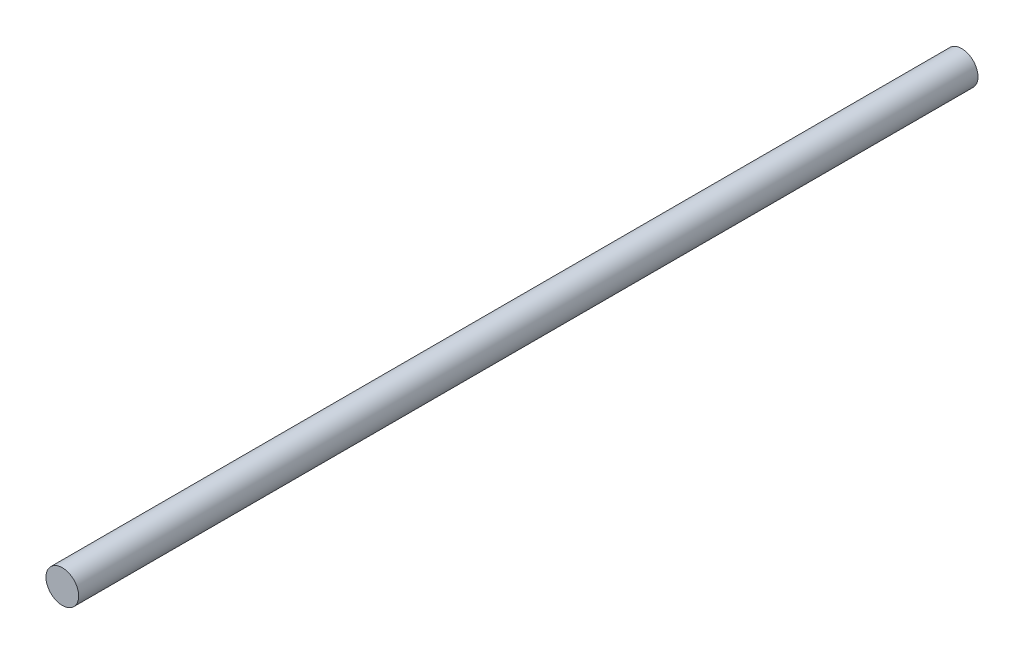
ISO-10303-21;
HEADER;
FILE_DESCRIPTION(('STEP AP214'),'2;1');
FILE_NAME('part.step','',(''),(''),'','','');
FILE_SCHEMA(('AUTOMOTIVE_DESIGN { 1 0 10303 214 1 1 1 1 }'));
ENDSEC;
DATA;
#1=APPLICATION_CONTEXT('core data for automotive mechanical design processes');
#2=APPLICATION_PROTOCOL_DEFINITION('international standard','automotive_design',2000,#1);
#3=PRODUCT_CONTEXT('',#1,'mechanical');
#4=PRODUCT('Part','Part','',(#3));
#5=PRODUCT_RELATED_PRODUCT_CATEGORY('part','',(#4));
#6=PRODUCT_DEFINITION_FORMATION('','',#4);
#7=PRODUCT_DEFINITION_CONTEXT('part definition',#1,'design');
#8=PRODUCT_DEFINITION('design','',#6,#7);
#9=PRODUCT_DEFINITION_SHAPE('','',#8);
#10=(LENGTH_UNIT() NAMED_UNIT(*) SI_UNIT(.MILLI.,.METRE.));
#11=(NAMED_UNIT(*) PLANE_ANGLE_UNIT() SI_UNIT($,.RADIAN.));
#12=(NAMED_UNIT(*) SI_UNIT($,.STERADIAN.) SOLID_ANGLE_UNIT());
#13=UNCERTAINTY_MEASURE_WITH_UNIT(LENGTH_MEASURE(1.E-05),#10,'distance_accuracy_value','');
#14=(GEOMETRIC_REPRESENTATION_CONTEXT(3) GLOBAL_UNCERTAINTY_ASSIGNED_CONTEXT((#13)) GLOBAL_UNIT_ASSIGNED_CONTEXT((#10,
#11,#12)) REPRESENTATION_CONTEXT('',''));
#15=CARTESIAN_POINT('',(0.,0.,0.));
#16=DIRECTION('',(0.,0.,1.));
#17=DIRECTION('',(1.,0.,0.));
#18=AXIS2_PLACEMENT_3D('',#15,#16,#17);
#19=CARTESIAN_POINT('',(0.,0.,165.));
#20=DIRECTION('',(0.,0.,-1.));
#21=DIRECTION('',(-1.,0.,0.));
#22=AXIS2_PLACEMENT_3D('',#19,#20,#21);
#23=CYLINDRICAL_SURFACE('',#22,3.);
#24=CARTESIAN_POINT('',(0.,0.,165.));
#25=DIRECTION('',(0.,0.,1.));
#26=DIRECTION('',(1.,0.,0.));
#27=AXIS2_PLACEMENT_3D('',#24,#25,#26);
#28=CIRCLE('',#27,3.);
#29=CARTESIAN_POINT('',(3.,0.,165.));
#30=VERTEX_POINT('',#29);
#31=EDGE_CURVE('E10',#30,#30,#28,.T.);
#32=ORIENTED_EDGE('',*,*,#31,.F.);
#33=EDGE_LOOP('',(#32));
#34=FACE_BOUND('',#33,.T.);
#35=CARTESIAN_POINT('',(0.,0.,0.));
#36=DIRECTION('',(0.,0.,1.));
#37=DIRECTION('',(1.,0.,0.));
#38=AXIS2_PLACEMENT_3D('',#35,#36,#37);
#39=CIRCLE('',#38,3.);
#40=CARTESIAN_POINT('',(3.,0.,0.));
#41=VERTEX_POINT('',#40);
#42=EDGE_CURVE('E40',#41,#41,#39,.T.);
#43=ORIENTED_EDGE('',*,*,#42,.T.);
#44=EDGE_LOOP('',(#43));
#45=FACE_BOUND('',#44,.T.);
#46=ADVANCED_FACE('F37',(#34,#45),#23,.T.);
#47=CARTESIAN_POINT('',(0.,0.,165.));
#48=DIRECTION('',(0.,0.,1.));
#49=DIRECTION('',(1.,0.,0.));
#50=AXIS2_PLACEMENT_3D('',#47,#48,#49);
#51=PLANE('',#50);
#52=ORIENTED_EDGE('',*,*,#31,.T.);
#53=EDGE_LOOP('',(#52));
#54=FACE_BOUND('',#53,.T.);
#55=ADVANCED_FACE('F54',(#54),#51,.T.);
#56=CARTESIAN_POINT('',(0.,0.,0.));
#57=DIRECTION('',(0.,0.,1.));
#58=DIRECTION('',(1.,0.,0.));
#59=AXIS2_PLACEMENT_3D('',#56,#57,#58);
#60=PLANE('',#59);
#61=ORIENTED_EDGE('',*,*,#42,.F.);
#62=EDGE_LOOP('',(#61));
#63=FACE_BOUND('',#62,.T.);
#64=ADVANCED_FACE('F52',(#63),#60,.F.);
#65=CLOSED_SHELL('',(#46,#55,#64));
#66=MANIFOLD_SOLID_BREP('B2',#65);
#67=ADVANCED_BREP_SHAPE_REPRESENTATION('',(#18,#66),#14);
#68=SHAPE_DEFINITION_REPRESENTATION(#9,#67);
ENDSEC;
END-ISO-10303-21;
